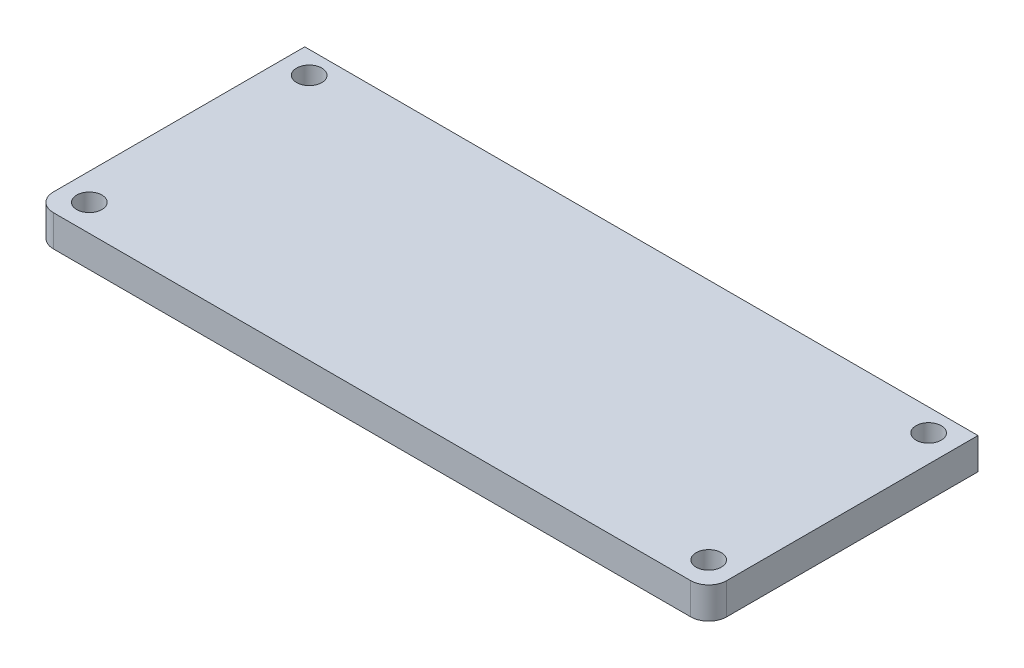
ISO-10303-21;
HEADER;
FILE_DESCRIPTION(('STEP AP214'),'2;1');
FILE_NAME('part.step','',(''),(''),'','','');
FILE_SCHEMA(('AUTOMOTIVE_DESIGN { 1 0 10303 214 1 1 1 1 }'));
ENDSEC;
DATA;
#1=APPLICATION_CONTEXT('core data for automotive mechanical design processes');
#2=APPLICATION_PROTOCOL_DEFINITION('international standard','automotive_design',2000,#1);
#3=PRODUCT_CONTEXT('',#1,'mechanical');
#4=PRODUCT('Part','Part','',(#3));
#5=PRODUCT_RELATED_PRODUCT_CATEGORY('part','',(#4));
#6=PRODUCT_DEFINITION_FORMATION('','',#4);
#7=PRODUCT_DEFINITION_CONTEXT('part definition',#1,'design');
#8=PRODUCT_DEFINITION('design','',#6,#7);
#9=PRODUCT_DEFINITION_SHAPE('','',#8);
#10=(LENGTH_UNIT() NAMED_UNIT(*) SI_UNIT(.MILLI.,.METRE.));
#11=(NAMED_UNIT(*) PLANE_ANGLE_UNIT() SI_UNIT($,.RADIAN.));
#12=(NAMED_UNIT(*) SI_UNIT($,.STERADIAN.) SOLID_ANGLE_UNIT());
#13=UNCERTAINTY_MEASURE_WITH_UNIT(LENGTH_MEASURE(1.E-05),#10,'distance_accuracy_value','');
#14=(GEOMETRIC_REPRESENTATION_CONTEXT(3) GLOBAL_UNCERTAINTY_ASSIGNED_CONTEXT((#13)) GLOBAL_UNIT_ASSIGNED_CONTEXT((#10,
#11,#12)) REPRESENTATION_CONTEXT('',''));
#15=CARTESIAN_POINT('',(0.,0.,0.));
#16=DIRECTION('',(0.,0.,1.));
#17=DIRECTION('',(1.,0.,0.));
#18=AXIS2_PLACEMENT_3D('',#15,#16,#17);
#19=CARTESIAN_POINT('',(-95.25,8.89,38.1));
#20=DIRECTION('',(1.,0.,0.));
#21=DIRECTION('',(0.,0.,-1.));
#22=AXIS2_PLACEMENT_3D('',#19,#20,#21);
#23=PLANE('',#22);
#24=DIRECTION('',(0.,0.,1.));
#25=VECTOR('',#24,1.);
#26=CARTESIAN_POINT('',(-95.25,0.,38.1));
#27=LINE('',#26,#25);
#28=CARTESIAN_POINT('',(-95.25,0.,-38.1));
#29=VERTEX_POINT('',#28);
#30=CARTESIAN_POINT('',(-95.25,0.,33.02));
#31=VERTEX_POINT('',#30);
#32=EDGE_CURVE('E114',#29,#31,#27,.T.);
#33=ORIENTED_EDGE('',*,*,#32,.T.);
#34=DIRECTION('',(0.,-1.,0.));
#35=VECTOR('',#34,1.);
#36=CARTESIAN_POINT('',(-95.25,8.89,33.02));
#37=LINE('',#36,#35);
#38=CARTESIAN_POINT('',(-95.25,8.89,33.02));
#39=VERTEX_POINT('',#38);
#40=EDGE_CURVE('E11',#31,#39,#37,.F.);
#41=ORIENTED_EDGE('',*,*,#40,.T.);
#42=DIRECTION('',(0.,0.,1.));
#43=VECTOR('',#42,1.);
#44=CARTESIAN_POINT('',(-95.25,8.89,38.1));
#45=LINE('',#44,#43);
#46=CARTESIAN_POINT('',(-95.25,8.89,-38.1));
#47=VERTEX_POINT('',#46);
#48=EDGE_CURVE('E121',#47,#39,#45,.T.);
#49=ORIENTED_EDGE('',*,*,#48,.F.);
#50=DIRECTION('',(0.,-1.,0.));
#51=VECTOR('',#50,1.);
#52=CARTESIAN_POINT('',(-95.25,8.89,-38.1));
#53=LINE('',#52,#51);
#54=EDGE_CURVE('E106',#47,#29,#53,.T.);
#55=ORIENTED_EDGE('',*,*,#54,.T.);
#56=EDGE_LOOP('',(#33,#41,#49,#55));
#57=FACE_BOUND('',#56,.T.);
#58=ADVANCED_FACE('F32',(#57),#23,.F.);
#59=CARTESIAN_POINT('',(95.25,8.89,38.1));
#60=DIRECTION('',(0.,0.,-1.));
#61=DIRECTION('',(-1.,0.,0.));
#62=AXIS2_PLACEMENT_3D('',#59,#60,#61);
#63=PLANE('',#62);
#64=DIRECTION('',(1.,0.,0.));
#65=VECTOR('',#64,1.);
#66=CARTESIAN_POINT('',(95.25,0.,38.1));
#67=LINE('',#66,#65);
#68=CARTESIAN_POINT('',(-90.17,0.,38.1));
#69=VERTEX_POINT('',#68);
#70=CARTESIAN_POINT('',(90.17,0.,38.1));
#71=VERTEX_POINT('',#70);
#72=EDGE_CURVE('E116',#69,#71,#67,.T.);
#73=ORIENTED_EDGE('',*,*,#72,.T.);
#74=DIRECTION('',(0.,-1.,0.));
#75=VECTOR('',#74,1.);
#76=CARTESIAN_POINT('',(90.17,8.89,38.1));
#77=LINE('',#76,#75);
#78=CARTESIAN_POINT('',(90.17,8.89,38.1));
#79=VERTEX_POINT('',#78);
#80=EDGE_CURVE('E53',#71,#79,#77,.F.);
#81=ORIENTED_EDGE('',*,*,#80,.T.);
#82=DIRECTION('',(1.,0.,0.));
#83=VECTOR('',#82,1.);
#84=CARTESIAN_POINT('',(95.25,8.89,38.1));
#85=LINE('',#84,#83);
#86=CARTESIAN_POINT('',(-90.17,8.89,38.1));
#87=VERTEX_POINT('',#86);
#88=EDGE_CURVE('E96',#87,#79,#85,.T.);
#89=ORIENTED_EDGE('',*,*,#88,.F.);
#90=DIRECTION('',(0.,-1.,0.));
#91=VECTOR('',#90,1.);
#92=CARTESIAN_POINT('',(-90.17,8.89,38.1));
#93=LINE('',#92,#91);
#94=EDGE_CURVE('E128',#87,#69,#93,.T.);
#95=ORIENTED_EDGE('',*,*,#94,.T.);
#96=EDGE_LOOP('',(#73,#81,#89,#95));
#97=FACE_BOUND('',#96,.T.);
#98=ADVANCED_FACE('F136',(#97),#63,.F.);
#99=CARTESIAN_POINT('',(95.25,8.89,38.1));
#100=DIRECTION('',(-1.,0.,0.));
#101=DIRECTION('',(0.,0.,1.));
#102=AXIS2_PLACEMENT_3D('',#99,#100,#101);
#103=PLANE('',#102);
#104=DIRECTION('',(0.,0.,-1.));
#105=VECTOR('',#104,1.);
#106=CARTESIAN_POINT('',(95.25,8.89,38.1));
#107=LINE('',#106,#105);
#108=CARTESIAN_POINT('',(95.25,8.89,33.02));
#109=VERTEX_POINT('',#108);
#110=CARTESIAN_POINT('',(95.25,8.89,-38.1));
#111=VERTEX_POINT('',#110);
#112=EDGE_CURVE('E86',#109,#111,#107,.T.);
#113=ORIENTED_EDGE('',*,*,#112,.F.);
#114=DIRECTION('',(0.,-1.,0.));
#115=VECTOR('',#114,1.);
#116=CARTESIAN_POINT('',(95.25,8.89,33.02));
#117=LINE('',#116,#115);
#118=CARTESIAN_POINT('',(95.25,0.,33.02));
#119=VERTEX_POINT('',#118);
#120=EDGE_CURVE('E105',#109,#119,#117,.T.);
#121=ORIENTED_EDGE('',*,*,#120,.T.);
#122=DIRECTION('',(0.,0.,-1.));
#123=VECTOR('',#122,1.);
#124=CARTESIAN_POINT('',(95.25,0.,38.1));
#125=LINE('',#124,#123);
#126=CARTESIAN_POINT('',(95.25,0.,-38.1));
#127=VERTEX_POINT('',#126);
#128=EDGE_CURVE('E102',#119,#127,#125,.T.);
#129=ORIENTED_EDGE('',*,*,#128,.T.);
#130=DIRECTION('',(0.,-1.,0.));
#131=VECTOR('',#130,1.);
#132=CARTESIAN_POINT('',(95.25,8.89,-38.1));
#133=LINE('',#132,#131);
#134=EDGE_CURVE('E99',#111,#127,#133,.T.);
#135=ORIENTED_EDGE('',*,*,#134,.F.);
#136=EDGE_LOOP('',(#113,#121,#129,#135));
#137=FACE_BOUND('',#136,.T.);
#138=ADVANCED_FACE('F100',(#137),#103,.F.);
#139=CARTESIAN_POINT('',(95.25,8.89,-38.1));
#140=DIRECTION('',(0.,0.,1.));
#141=DIRECTION('',(1.,0.,0.));
#142=AXIS2_PLACEMENT_3D('',#139,#140,#141);
#143=PLANE('',#142);
#144=DIRECTION('',(-1.,0.,0.));
#145=VECTOR('',#144,1.);
#146=CARTESIAN_POINT('',(95.25,0.,-38.1));
#147=LINE('',#146,#145);
#148=EDGE_CURVE('E120',#127,#29,#147,.T.);
#149=ORIENTED_EDGE('',*,*,#148,.T.);
#150=ORIENTED_EDGE('',*,*,#54,.F.);
#151=DIRECTION('',(-1.,0.,0.));
#152=VECTOR('',#151,1.);
#153=CARTESIAN_POINT('',(95.25,8.89,-38.1));
#154=LINE('',#153,#152);
#155=EDGE_CURVE('E90',#111,#47,#154,.T.);
#156=ORIENTED_EDGE('',*,*,#155,.F.);
#157=ORIENTED_EDGE('',*,*,#134,.T.);
#158=EDGE_LOOP('',(#149,#150,#156,#157));
#159=FACE_BOUND('',#158,.T.);
#160=ADVANCED_FACE('F108',(#159),#143,.F.);
#161=CARTESIAN_POINT('',(-95.25,8.89,-38.1));
#162=DIRECTION('',(0.,1.,0.));
#163=DIRECTION('',(0.,0.,1.));
#164=AXIS2_PLACEMENT_3D('',#161,#162,#163);
#165=PLANE('',#164);
#166=CARTESIAN_POINT('',(-87.63,8.89,-31.75));
#167=DIRECTION('',(0.,1.,0.));
#168=DIRECTION('',(0.,0.,1.));
#169=AXIS2_PLACEMENT_3D('',#166,#167,#168);
#170=CIRCLE('',#169,3.57123999999999);
#171=CARTESIAN_POINT('',(-87.63,8.89,-28.17876));
#172=VERTEX_POINT('',#171);
#173=EDGE_CURVE('E163',#172,#172,#170,.T.);
#174=ORIENTED_EDGE('',*,*,#173,.F.);
#175=EDGE_LOOP('',(#174));
#176=FACE_BOUND('',#175,.T.);
#177=CARTESIAN_POINT('',(87.63,8.89,-31.75));
#178=DIRECTION('',(0.,1.,0.));
#179=DIRECTION('',(0.,0.,1.));
#180=AXIS2_PLACEMENT_3D('',#177,#178,#179);
#181=CIRCLE('',#180,3.57123999999999);
#182=CARTESIAN_POINT('',(87.63,8.89,-28.17876));
#183=VERTEX_POINT('',#182);
#184=EDGE_CURVE('E157',#183,#183,#181,.T.);
#185=ORIENTED_EDGE('',*,*,#184,.F.);
#186=EDGE_LOOP('',(#185));
#187=FACE_BOUND('',#186,.T.);
#188=CARTESIAN_POINT('',(87.63,8.89,30.48));
#189=DIRECTION('',(0.,1.,0.));
#190=DIRECTION('',(0.,0.,1.));
#191=AXIS2_PLACEMENT_3D('',#188,#189,#190);
#192=CIRCLE('',#191,3.57123999999999);
#193=CARTESIAN_POINT('',(87.63,8.89,34.05124));
#194=VERTEX_POINT('',#193);
#195=EDGE_CURVE('E151',#194,#194,#192,.T.);
#196=ORIENTED_EDGE('',*,*,#195,.F.);
#197=EDGE_LOOP('',(#196));
#198=FACE_BOUND('',#197,.T.);
#199=CARTESIAN_POINT('',(-87.63,8.89,30.48));
#200=DIRECTION('',(0.,1.,0.));
#201=DIRECTION('',(0.,0.,1.));
#202=AXIS2_PLACEMENT_3D('',#199,#200,#201);
#203=CIRCLE('',#202,3.57123999999999);
#204=CARTESIAN_POINT('',(-87.63,8.89,34.05124));
#205=VERTEX_POINT('',#204);
#206=EDGE_CURVE('E145',#205,#205,#203,.T.);
#207=ORIENTED_EDGE('',*,*,#206,.F.);
#208=EDGE_LOOP('',(#207));
#209=FACE_BOUND('',#208,.T.);
#210=ORIENTED_EDGE('',*,*,#88,.T.);
#211=CARTESIAN_POINT('',(90.17,8.89,33.02));
#212=DIRECTION('',(0.,1.,0.));
#213=DIRECTION('',(0.,0.,1.));
#214=AXIS2_PLACEMENT_3D('',#211,#212,#213);
#215=CIRCLE('',#214,5.08);
#216=EDGE_CURVE('E40',#79,#109,#215,.T.);
#217=ORIENTED_EDGE('',*,*,#216,.T.);
#218=ORIENTED_EDGE('',*,*,#112,.T.);
#219=ORIENTED_EDGE('',*,*,#155,.T.);
#220=ORIENTED_EDGE('',*,*,#48,.T.);
#221=CARTESIAN_POINT('',(-90.17,8.89,33.02));
#222=DIRECTION('',(0.,1.,0.));
#223=DIRECTION('',(0.,0.,1.));
#224=AXIS2_PLACEMENT_3D('',#221,#222,#223);
#225=CIRCLE('',#224,5.08);
#226=EDGE_CURVE('E132',#39,#87,#225,.T.);
#227=ORIENTED_EDGE('',*,*,#226,.T.);
#228=EDGE_LOOP('',(#210,#217,#218,#219,#220,#227));
#229=FACE_BOUND('',#228,.T.);
#230=ADVANCED_FACE('F88',(#176,#187,#198,#209,#229),#165,.T.);
#231=CARTESIAN_POINT('',(-95.25,0.,-38.1));
#232=DIRECTION('',(0.,1.,0.));
#233=DIRECTION('',(0.,0.,1.));
#234=AXIS2_PLACEMENT_3D('',#231,#232,#233);
#235=PLANE('',#234);
#236=CARTESIAN_POINT('',(-87.63,0.,-31.75));
#237=DIRECTION('',(0.,1.,0.));
#238=DIRECTION('',(0.,0.,1.));
#239=AXIS2_PLACEMENT_3D('',#236,#237,#238);
#240=CIRCLE('',#239,3.57124);
#241=CARTESIAN_POINT('',(-87.63,0.,-28.17876));
#242=VERTEX_POINT('',#241);
#243=EDGE_CURVE('E160',#242,#242,#240,.T.);
#244=ORIENTED_EDGE('',*,*,#243,.T.);
#245=EDGE_LOOP('',(#244));
#246=FACE_BOUND('',#245,.T.);
#247=CARTESIAN_POINT('',(87.63,0.,-31.75));
#248=DIRECTION('',(0.,1.,0.));
#249=DIRECTION('',(0.,0.,1.));
#250=AXIS2_PLACEMENT_3D('',#247,#248,#249);
#251=CIRCLE('',#250,3.57124);
#252=CARTESIAN_POINT('',(87.63,0.,-28.17876));
#253=VERTEX_POINT('',#252);
#254=EDGE_CURVE('E154',#253,#253,#251,.T.);
#255=ORIENTED_EDGE('',*,*,#254,.T.);
#256=EDGE_LOOP('',(#255));
#257=FACE_BOUND('',#256,.T.);
#258=CARTESIAN_POINT('',(87.63,0.,30.48));
#259=DIRECTION('',(0.,1.,0.));
#260=DIRECTION('',(0.,0.,1.));
#261=AXIS2_PLACEMENT_3D('',#258,#259,#260);
#262=CIRCLE('',#261,3.57124);
#263=CARTESIAN_POINT('',(87.63,0.,34.05124));
#264=VERTEX_POINT('',#263);
#265=EDGE_CURVE('E148',#264,#264,#262,.T.);
#266=ORIENTED_EDGE('',*,*,#265,.T.);
#267=EDGE_LOOP('',(#266));
#268=FACE_BOUND('',#267,.T.);
#269=CARTESIAN_POINT('',(-87.63,0.,30.48));
#270=DIRECTION('',(0.,1.,0.));
#271=DIRECTION('',(0.,0.,1.));
#272=AXIS2_PLACEMENT_3D('',#269,#270,#271);
#273=CIRCLE('',#272,3.57124);
#274=CARTESIAN_POINT('',(-87.63,0.,34.05124));
#275=VERTEX_POINT('',#274);
#276=EDGE_CURVE('E117',#275,#275,#273,.T.);
#277=ORIENTED_EDGE('',*,*,#276,.T.);
#278=EDGE_LOOP('',(#277));
#279=FACE_BOUND('',#278,.T.);
#280=ORIENTED_EDGE('',*,*,#128,.F.);
#281=CARTESIAN_POINT('',(90.17,0.,33.02));
#282=DIRECTION('',(0.,1.,0.));
#283=DIRECTION('',(0.,0.,1.));
#284=AXIS2_PLACEMENT_3D('',#281,#282,#283);
#285=CIRCLE('',#284,5.08);
#286=EDGE_CURVE('E126',#119,#71,#285,.F.);
#287=ORIENTED_EDGE('',*,*,#286,.T.);
#288=ORIENTED_EDGE('',*,*,#72,.F.);
#289=CARTESIAN_POINT('',(-90.17,0.,33.02));
#290=DIRECTION('',(0.,1.,0.));
#291=DIRECTION('',(0.,0.,1.));
#292=AXIS2_PLACEMENT_3D('',#289,#290,#291);
#293=CIRCLE('',#292,5.08);
#294=EDGE_CURVE('E124',#69,#31,#293,.F.);
#295=ORIENTED_EDGE('',*,*,#294,.T.);
#296=ORIENTED_EDGE('',*,*,#32,.F.);
#297=ORIENTED_EDGE('',*,*,#148,.F.);
#298=EDGE_LOOP('',(#280,#287,#288,#295,#296,#297));
#299=FACE_BOUND('',#298,.T.);
#300=ADVANCED_FACE('F140',(#246,#257,#268,#279,#299),#235,.F.);
#301=CARTESIAN_POINT('',(-87.63,8.89,30.48));
#302=DIRECTION('',(0.,1.,0.));
#303=DIRECTION('',(0.,0.,1.));
#304=AXIS2_PLACEMENT_3D('',#301,#302,#303);
#305=CYLINDRICAL_SURFACE('',#304,3.57124);
#306=ORIENTED_EDGE('',*,*,#276,.F.);
#307=EDGE_LOOP('',(#306));
#308=FACE_BOUND('',#307,.T.);
#309=ORIENTED_EDGE('',*,*,#206,.T.);
#310=EDGE_LOOP('',(#309));
#311=FACE_BOUND('',#310,.T.);
#312=ADVANCED_FACE('F178',(#308,#311),#305,.F.);
#313=CARTESIAN_POINT('',(87.63,8.89,30.48));
#314=DIRECTION('',(0.,1.,0.));
#315=DIRECTION('',(0.,0.,1.));
#316=AXIS2_PLACEMENT_3D('',#313,#314,#315);
#317=CYLINDRICAL_SURFACE('',#316,3.57124);
#318=ORIENTED_EDGE('',*,*,#265,.F.);
#319=EDGE_LOOP('',(#318));
#320=FACE_BOUND('',#319,.T.);
#321=ORIENTED_EDGE('',*,*,#195,.T.);
#322=EDGE_LOOP('',(#321));
#323=FACE_BOUND('',#322,.T.);
#324=ADVANCED_FACE('F180',(#320,#323),#317,.F.);
#325=CARTESIAN_POINT('',(87.63,8.89,-31.75));
#326=DIRECTION('',(0.,1.,0.));
#327=DIRECTION('',(0.,0.,1.));
#328=AXIS2_PLACEMENT_3D('',#325,#326,#327);
#329=CYLINDRICAL_SURFACE('',#328,3.57124);
#330=ORIENTED_EDGE('',*,*,#254,.F.);
#331=EDGE_LOOP('',(#330));
#332=FACE_BOUND('',#331,.T.);
#333=ORIENTED_EDGE('',*,*,#184,.T.);
#334=EDGE_LOOP('',(#333));
#335=FACE_BOUND('',#334,.T.);
#336=ADVANCED_FACE('F187',(#332,#335),#329,.F.);
#337=CARTESIAN_POINT('',(-87.63,8.89,-31.75));
#338=DIRECTION('',(0.,1.,0.));
#339=DIRECTION('',(0.,0.,1.));
#340=AXIS2_PLACEMENT_3D('',#337,#338,#339);
#341=CYLINDRICAL_SURFACE('',#340,3.57124);
#342=ORIENTED_EDGE('',*,*,#243,.F.);
#343=EDGE_LOOP('',(#342));
#344=FACE_BOUND('',#343,.T.);
#345=ORIENTED_EDGE('',*,*,#173,.T.);
#346=EDGE_LOOP('',(#345));
#347=FACE_BOUND('',#346,.T.);
#348=ADVANCED_FACE('F167',(#344,#347),#341,.F.);
#349=CARTESIAN_POINT('',(90.17,8.89,33.02));
#350=DIRECTION('',(0.,-1.,0.));
#351=DIRECTION('',(0.,0.,-1.));
#352=AXIS2_PLACEMENT_3D('',#349,#350,#351);
#353=CYLINDRICAL_SURFACE('',#352,5.08);
#354=ORIENTED_EDGE('',*,*,#216,.F.);
#355=ORIENTED_EDGE('',*,*,#80,.F.);
#356=ORIENTED_EDGE('',*,*,#286,.F.);
#357=ORIENTED_EDGE('',*,*,#120,.F.);
#358=EDGE_LOOP('',(#354,#355,#356,#357));
#359=FACE_BOUND('',#358,.T.);
#360=ADVANCED_FACE('F200',(#359),#353,.T.);
#361=CARTESIAN_POINT('',(-90.17,8.89,33.02));
#362=DIRECTION('',(0.,-1.,0.));
#363=DIRECTION('',(0.,0.,-1.));
#364=AXIS2_PLACEMENT_3D('',#361,#362,#363);
#365=CYLINDRICAL_SURFACE('',#364,5.08);
#366=ORIENTED_EDGE('',*,*,#226,.F.);
#367=ORIENTED_EDGE('',*,*,#40,.F.);
#368=ORIENTED_EDGE('',*,*,#294,.F.);
#369=ORIENTED_EDGE('',*,*,#94,.F.);
#370=EDGE_LOOP('',(#366,#367,#368,#369));
#371=FACE_BOUND('',#370,.T.);
#372=ADVANCED_FACE('F34',(#371),#365,.T.);
#373=CLOSED_SHELL('',(#58,#98,#138,#160,#230,#300,#312,#324,#336,#348,#360,#372));
#374=MANIFOLD_SOLID_BREP('B2',#373);
#375=ADVANCED_BREP_SHAPE_REPRESENTATION('',(#18,#374),#14);
#376=SHAPE_DEFINITION_REPRESENTATION(#9,#375);
ENDSEC;
END-ISO-10303-21;
